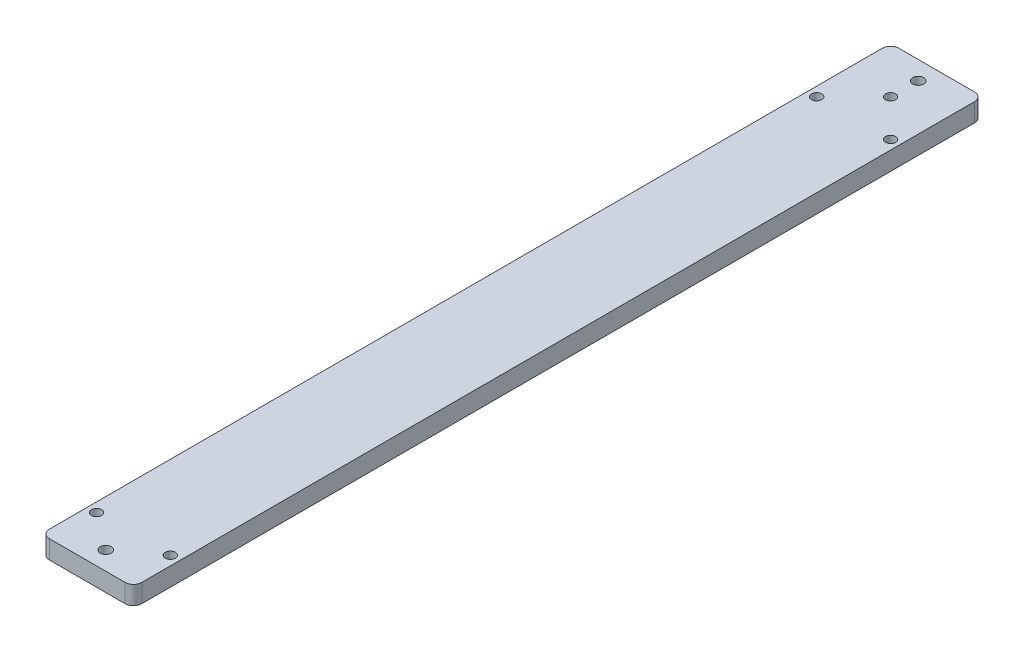
ISO-10303-21;
HEADER;
FILE_DESCRIPTION(('STEP AP214'),'2;1');
FILE_NAME('part.step','',(''),(''),'','','');
FILE_SCHEMA(('AUTOMOTIVE_DESIGN { 1 0 10303 214 1 1 1 1 }'));
ENDSEC;
DATA;
#1=APPLICATION_CONTEXT('core data for automotive mechanical design processes');
#2=APPLICATION_PROTOCOL_DEFINITION('international standard','automotive_design',2000,#1);
#3=PRODUCT_CONTEXT('',#1,'mechanical');
#4=PRODUCT('Part','Part','',(#3));
#5=PRODUCT_RELATED_PRODUCT_CATEGORY('part','',(#4));
#6=PRODUCT_DEFINITION_FORMATION('','',#4);
#7=PRODUCT_DEFINITION_CONTEXT('part definition',#1,'design');
#8=PRODUCT_DEFINITION('design','',#6,#7);
#9=PRODUCT_DEFINITION_SHAPE('','',#8);
#10=(LENGTH_UNIT() NAMED_UNIT(*) SI_UNIT(.MILLI.,.METRE.));
#11=(NAMED_UNIT(*) PLANE_ANGLE_UNIT() SI_UNIT($,.RADIAN.));
#12=(NAMED_UNIT(*) SI_UNIT($,.STERADIAN.) SOLID_ANGLE_UNIT());
#13=UNCERTAINTY_MEASURE_WITH_UNIT(LENGTH_MEASURE(1.E-05),#10,'distance_accuracy_value','');
#14=(GEOMETRIC_REPRESENTATION_CONTEXT(3) GLOBAL_UNCERTAINTY_ASSIGNED_CONTEXT((#13)) GLOBAL_UNIT_ASSIGNED_CONTEXT((#10,
#11,#12)) REPRESENTATION_CONTEXT('',''));
#15=CARTESIAN_POINT('',(0.,0.,0.));
#16=DIRECTION('',(0.,0.,1.));
#17=DIRECTION('',(1.,0.,0.));
#18=AXIS2_PLACEMENT_3D('',#15,#16,#17);
#19=CARTESIAN_POINT('',(32.3533259102885,0.000999999999999265,459.692172038795));
#20=DIRECTION('',(0.,-1.,0.));
#21=DIRECTION('',(0.,0.,-1.));
#22=AXIS2_PLACEMENT_3D('',#19,#20,#21);
#23=CYLINDRICAL_SURFACE('',#22,2.75);
#24=CARTESIAN_POINT('',(32.3533259102885,0.,459.692172038795));
#25=DIRECTION('',(0.,-1.,0.));
#26=DIRECTION('',(0.,0.,-1.));
#27=AXIS2_PLACEMENT_3D('',#24,#25,#26);
#28=CIRCLE('',#27,2.75);
#29=CARTESIAN_POINT('',(32.3533259102885,0.,456.942172038795));
#30=VERTEX_POINT('',#29);
#31=EDGE_CURVE('E163',#30,#30,#28,.F.);
#32=ORIENTED_EDGE('',*,*,#31,.T.);
#33=EDGE_LOOP('',(#32));
#34=FACE_BOUND('',#33,.T.);
#35=CARTESIAN_POINT('',(32.3533259102885,-4.5,459.692172038795));
#36=DIRECTION('',(0.,-1.,0.));
#37=DIRECTION('',(0.,0.,-1.));
#38=AXIS2_PLACEMENT_3D('',#35,#36,#37);
#39=CIRCLE('',#38,2.75);
#40=CARTESIAN_POINT('',(32.3533259102885,-4.5,456.942172038795));
#41=VERTEX_POINT('',#40);
#42=EDGE_CURVE('E165',#41,#41,#39,.F.);
#43=ORIENTED_EDGE('',*,*,#42,.F.);
#44=EDGE_LOOP('',(#43));
#45=FACE_BOUND('',#44,.T.);
#46=ADVANCED_FACE('F35',(#34,#45),#23,.F.);
#47=CARTESIAN_POINT('',(-7.64667408971147,0.000999999999999265,459.692172038795));
#48=DIRECTION('',(0.,-1.,0.));
#49=DIRECTION('',(0.,0.,-1.));
#50=AXIS2_PLACEMENT_3D('',#47,#48,#49);
#51=CYLINDRICAL_SURFACE('',#50,2.75);
#52=CARTESIAN_POINT('',(-7.64667408971147,0.,459.692172038795));
#53=DIRECTION('',(0.,-1.,0.));
#54=DIRECTION('',(0.,0.,-1.));
#55=AXIS2_PLACEMENT_3D('',#52,#53,#54);
#56=CIRCLE('',#55,2.75);
#57=CARTESIAN_POINT('',(-7.64667408971147,0.,456.942172038795));
#58=VERTEX_POINT('',#57);
#59=EDGE_CURVE('E226',#58,#58,#56,.F.);
#60=ORIENTED_EDGE('',*,*,#59,.T.);
#61=EDGE_LOOP('',(#60));
#62=FACE_BOUND('',#61,.T.);
#63=CARTESIAN_POINT('',(-7.64667408971147,-4.5,459.692172038795));
#64=DIRECTION('',(0.,-1.,0.));
#65=DIRECTION('',(0.,0.,-1.));
#66=AXIS2_PLACEMENT_3D('',#63,#64,#65);
#67=CIRCLE('',#66,2.75);
#68=CARTESIAN_POINT('',(-7.64667408971147,-4.5,456.942172038795));
#69=VERTEX_POINT('',#68);
#70=EDGE_CURVE('E160',#69,#69,#67,.F.);
#71=ORIENTED_EDGE('',*,*,#70,.F.);
#72=EDGE_LOOP('',(#71));
#73=FACE_BOUND('',#72,.T.);
#74=ADVANCED_FACE('F298',(#62,#73),#51,.F.);
#75=CARTESIAN_POINT('',(12.3533259102885,0.000999999999999265,49.6921720387952));
#76=DIRECTION('',(0.,-1.,0.));
#77=DIRECTION('',(0.,0.,-1.));
#78=AXIS2_PLACEMENT_3D('',#75,#76,#77);
#79=CYLINDRICAL_SURFACE('',#78,2.75);
#80=CARTESIAN_POINT('',(12.3533259102885,0.,49.6921720387952));
#81=DIRECTION('',(0.,-1.,0.));
#82=DIRECTION('',(0.,0.,-1.));
#83=AXIS2_PLACEMENT_3D('',#80,#81,#82);
#84=CIRCLE('',#83,2.75);
#85=CARTESIAN_POINT('',(12.3533259102885,0.,46.9421720387951));
#86=VERTEX_POINT('',#85);
#87=EDGE_CURVE('E148',#86,#86,#84,.F.);
#88=ORIENTED_EDGE('',*,*,#87,.T.);
#89=EDGE_LOOP('',(#88));
#90=FACE_BOUND('',#89,.T.);
#91=CARTESIAN_POINT('',(12.3533259102885,-4.5,49.6921720387952));
#92=DIRECTION('',(0.,-1.,0.));
#93=DIRECTION('',(0.,0.,-1.));
#94=AXIS2_PLACEMENT_3D('',#91,#92,#93);
#95=CIRCLE('',#94,2.75);
#96=CARTESIAN_POINT('',(12.3533259102885,-4.5,46.9421720387951));
#97=VERTEX_POINT('',#96);
#98=EDGE_CURVE('E155',#97,#97,#95,.F.);
#99=ORIENTED_EDGE('',*,*,#98,.F.);
#100=EDGE_LOOP('',(#99));
#101=FACE_BOUND('',#100,.T.);
#102=ADVANCED_FACE('F277',(#90,#101),#79,.F.);
#103=CARTESIAN_POINT('',(32.3533259102885,0.000999999999999265,69.6921720387952));
#104=DIRECTION('',(0.,-1.,0.));
#105=DIRECTION('',(0.,0.,-1.));
#106=AXIS2_PLACEMENT_3D('',#103,#104,#105);
#107=CYLINDRICAL_SURFACE('',#106,2.75);
#108=CARTESIAN_POINT('',(32.3533259102885,0.,69.6921720387952));
#109=DIRECTION('',(0.,-1.,0.));
#110=DIRECTION('',(0.,0.,-1.));
#111=AXIS2_PLACEMENT_3D('',#108,#109,#110);
#112=CIRCLE('',#111,2.75);
#113=CARTESIAN_POINT('',(32.3533259102885,0.,66.9421720387951));
#114=VERTEX_POINT('',#113);
#115=EDGE_CURVE('E130',#114,#114,#112,.F.);
#116=ORIENTED_EDGE('',*,*,#115,.T.);
#117=EDGE_LOOP('',(#116));
#118=FACE_BOUND('',#117,.T.);
#119=CARTESIAN_POINT('',(32.3533259102885,-4.5,69.6921720387952));
#120=DIRECTION('',(0.,-1.,0.));
#121=DIRECTION('',(0.,0.,-1.));
#122=AXIS2_PLACEMENT_3D('',#119,#120,#121);
#123=CIRCLE('',#122,2.75);
#124=CARTESIAN_POINT('',(32.3533259102885,-4.5,66.9421720387951));
#125=VERTEX_POINT('',#124);
#126=EDGE_CURVE('E150',#125,#125,#123,.F.);
#127=ORIENTED_EDGE('',*,*,#126,.F.);
#128=EDGE_LOOP('',(#127));
#129=FACE_BOUND('',#128,.T.);
#130=ADVANCED_FACE('F273',(#118,#129),#107,.F.);
#131=CARTESIAN_POINT('',(-7.64667408971147,0.000999999999999265,69.6921720387952));
#132=DIRECTION('',(0.,-1.,0.));
#133=DIRECTION('',(0.,0.,-1.));
#134=AXIS2_PLACEMENT_3D('',#131,#132,#133);
#135=CYLINDRICAL_SURFACE('',#134,2.75);
#136=CARTESIAN_POINT('',(-7.64667408971147,0.,69.6921720387952));
#137=DIRECTION('',(0.,-1.,0.));
#138=DIRECTION('',(0.,0.,-1.));
#139=AXIS2_PLACEMENT_3D('',#136,#137,#138);
#140=CIRCLE('',#139,2.75);
#141=CARTESIAN_POINT('',(-7.64667408971147,0.,66.9421720387951));
#142=VERTEX_POINT('',#141);
#143=EDGE_CURVE('E136',#142,#142,#140,.F.);
#144=ORIENTED_EDGE('',*,*,#143,.T.);
#145=EDGE_LOOP('',(#144));
#146=FACE_BOUND('',#145,.T.);
#147=CARTESIAN_POINT('',(-7.64667408971147,-4.5,69.6921720387952));
#148=DIRECTION('',(0.,-1.,0.));
#149=DIRECTION('',(0.,0.,-1.));
#150=AXIS2_PLACEMENT_3D('',#147,#148,#149);
#151=CIRCLE('',#150,2.75);
#152=CARTESIAN_POINT('',(-7.64667408971147,-4.5,66.9421720387951));
#153=VERTEX_POINT('',#152);
#154=EDGE_CURVE('E145',#153,#153,#151,.F.);
#155=ORIENTED_EDGE('',*,*,#154,.F.);
#156=EDGE_LOOP('',(#155));
#157=FACE_BOUND('',#156,.T.);
#158=ADVANCED_FACE('F276',(#146,#157),#135,.F.);
#159=CARTESIAN_POINT('',(37.3533259102885,-10.,24.6921720387952));
#160=DIRECTION('',(-1.,0.,0.));
#161=DIRECTION('',(0.,0.,1.));
#162=AXIS2_PLACEMENT_3D('',#159,#160,#161);
#163=PLANE('',#162);
#164=DIRECTION('',(0.,0.,1.));
#165=VECTOR('',#164,1.);
#166=CARTESIAN_POINT('',(37.3533259102885,-10.,24.6921720387952));
#167=LINE('',#166,#165);
#168=CARTESIAN_POINT('',(37.3533259102885,-10.,29.1921720387952));
#169=VERTEX_POINT('',#168);
#170=CARTESIAN_POINT('',(37.3533259102885,-10.,480.192172038795));
#171=VERTEX_POINT('',#170);
#172=EDGE_CURVE('E122',#169,#171,#167,.T.);
#173=ORIENTED_EDGE('',*,*,#172,.F.);
#174=DIRECTION('',(0.,1.,0.));
#175=VECTOR('',#174,1.);
#176=CARTESIAN_POINT('',(37.3533259102885,-10.,29.1921720387952));
#177=LINE('',#176,#175);
#178=CARTESIAN_POINT('',(37.3533259102885,0.,29.1921720387952));
#179=VERTEX_POINT('',#178);
#180=EDGE_CURVE('E106',#169,#179,#177,.T.);
#181=ORIENTED_EDGE('',*,*,#180,.T.);
#182=DIRECTION('',(0.,0.,1.));
#183=VECTOR('',#182,1.);
#184=CARTESIAN_POINT('',(37.3533259102885,0.,24.6921720387952));
#185=LINE('',#184,#183);
#186=CARTESIAN_POINT('',(37.3533259102885,0.,480.192172038795));
#187=VERTEX_POINT('',#186);
#188=EDGE_CURVE('E119',#179,#187,#185,.T.);
#189=ORIENTED_EDGE('',*,*,#188,.T.);
#190=DIRECTION('',(0.,1.,0.));
#191=VECTOR('',#190,1.);
#192=CARTESIAN_POINT('',(37.3533259102885,-10.,480.192172038795));
#193=LINE('',#192,#191);
#194=EDGE_CURVE('E124',#187,#171,#193,.F.);
#195=ORIENTED_EDGE('',*,*,#194,.T.);
#196=EDGE_LOOP('',(#173,#181,#189,#195));
#197=FACE_BOUND('',#196,.T.);
#198=ADVANCED_FACE('F118',(#197),#163,.F.);
#199=CARTESIAN_POINT('',(37.3533259102885,-10.,484.692172038795));
#200=DIRECTION('',(0.,0.,-1.));
#201=DIRECTION('',(-1.,0.,0.));
#202=AXIS2_PLACEMENT_3D('',#199,#200,#201);
#203=PLANE('',#202);
#204=DIRECTION('',(-1.,0.,0.));
#205=VECTOR('',#204,1.);
#206=CARTESIAN_POINT('',(37.3533259102885,-10.,484.692172038795));
#207=LINE('',#206,#205);
#208=CARTESIAN_POINT('',(32.8533259102885,-10.,484.692172038795));
#209=VERTEX_POINT('',#208);
#210=CARTESIAN_POINT('',(-8.14667408971147,-10.,484.692172038795));
#211=VERTEX_POINT('',#210);
#212=EDGE_CURVE('E191',#209,#211,#207,.T.);
#213=ORIENTED_EDGE('',*,*,#212,.F.);
#214=DIRECTION('',(0.,1.,0.));
#215=VECTOR('',#214,1.);
#216=CARTESIAN_POINT('',(32.8533259102885,-10.,484.692172038795));
#217=LINE('',#216,#215);
#218=CARTESIAN_POINT('',(32.8533259102885,0.,484.692172038795));
#219=VERTEX_POINT('',#218);
#220=EDGE_CURVE('E12',#209,#219,#217,.T.);
#221=ORIENTED_EDGE('',*,*,#220,.T.);
#222=DIRECTION('',(-1.,0.,0.));
#223=VECTOR('',#222,1.);
#224=CARTESIAN_POINT('',(37.3533259102885,0.,484.692172038795));
#225=LINE('',#224,#223);
#226=CARTESIAN_POINT('',(-8.14667408971147,0.,484.692172038795));
#227=VERTEX_POINT('',#226);
#228=EDGE_CURVE('E129',#219,#227,#225,.T.);
#229=ORIENTED_EDGE('',*,*,#228,.T.);
#230=DIRECTION('',(0.,1.,0.));
#231=VECTOR('',#230,1.);
#232=CARTESIAN_POINT('',(-8.14667408971147,-10.,484.692172038795));
#233=LINE('',#232,#231);
#234=EDGE_CURVE('E43',#227,#211,#233,.F.);
#235=ORIENTED_EDGE('',*,*,#234,.T.);
#236=EDGE_LOOP('',(#213,#221,#229,#235));
#237=FACE_BOUND('',#236,.T.);
#238=ADVANCED_FACE('F190',(#237),#203,.F.);
#239=CARTESIAN_POINT('',(-12.6466740897115,-10.,24.6921720387951));
#240=DIRECTION('',(1.,0.,0.));
#241=DIRECTION('',(0.,0.,-1.));
#242=AXIS2_PLACEMENT_3D('',#239,#240,#241);
#243=PLANE('',#242);
#244=DIRECTION('',(0.,0.,-1.));
#245=VECTOR('',#244,1.);
#246=CARTESIAN_POINT('',(-12.6466740897115,0.,24.6921720387951));
#247=LINE('',#246,#245);
#248=CARTESIAN_POINT('',(-12.6466740897115,0.,480.192172038795));
#249=VERTEX_POINT('',#248);
#250=CARTESIAN_POINT('',(-12.6466740897115,0.,29.1921720387951));
#251=VERTEX_POINT('',#250);
#252=EDGE_CURVE('E133',#249,#251,#247,.T.);
#253=ORIENTED_EDGE('',*,*,#252,.T.);
#254=DIRECTION('',(0.,1.,0.));
#255=VECTOR('',#254,1.);
#256=CARTESIAN_POINT('',(-12.6466740897115,-10.,29.1921720387951));
#257=LINE('',#256,#255);
#258=CARTESIAN_POINT('',(-12.6466740897115,-10.,29.1921720387951));
#259=VERTEX_POINT('',#258);
#260=EDGE_CURVE('E50',#251,#259,#257,.F.);
#261=ORIENTED_EDGE('',*,*,#260,.T.);
#262=DIRECTION('',(0.,0.,-1.));
#263=VECTOR('',#262,1.);
#264=CARTESIAN_POINT('',(-12.6466740897115,-10.,24.6921720387951));
#265=LINE('',#264,#263);
#266=CARTESIAN_POINT('',(-12.6466740897115,-10.,480.192172038795));
#267=VERTEX_POINT('',#266);
#268=EDGE_CURVE('E197',#267,#259,#265,.T.);
#269=ORIENTED_EDGE('',*,*,#268,.F.);
#270=DIRECTION('',(0.,1.,0.));
#271=VECTOR('',#270,1.);
#272=CARTESIAN_POINT('',(-12.6466740897115,-10.,480.192172038795));
#273=LINE('',#272,#271);
#274=EDGE_CURVE('E184',#267,#249,#273,.T.);
#275=ORIENTED_EDGE('',*,*,#274,.T.);
#276=EDGE_LOOP('',(#253,#261,#269,#275));
#277=FACE_BOUND('',#276,.T.);
#278=ADVANCED_FACE('F201',(#277),#243,.F.);
#279=CARTESIAN_POINT('',(37.3533259102885,-10.,24.6921720387952));
#280=DIRECTION('',(0.,0.,1.));
#281=DIRECTION('',(1.,0.,0.));
#282=AXIS2_PLACEMENT_3D('',#279,#280,#281);
#283=PLANE('',#282);
#284=DIRECTION('',(1.,0.,0.));
#285=VECTOR('',#284,1.);
#286=CARTESIAN_POINT('',(37.3533259102885,0.,24.6921720387952));
#287=LINE('',#286,#285);
#288=CARTESIAN_POINT('',(-8.14667408971147,0.,24.6921720387951));
#289=VERTEX_POINT('',#288);
#290=CARTESIAN_POINT('',(32.8533259102885,0.,24.6921720387952));
#291=VERTEX_POINT('',#290);
#292=EDGE_CURVE('E143',#289,#291,#287,.T.);
#293=ORIENTED_EDGE('',*,*,#292,.T.);
#294=DIRECTION('',(0.,1.,0.));
#295=VECTOR('',#294,1.);
#296=CARTESIAN_POINT('',(32.8533259102885,-10.,24.6921720387952));
#297=LINE('',#296,#295);
#298=CARTESIAN_POINT('',(32.8533259102885,-10.,24.6921720387952));
#299=VERTEX_POINT('',#298);
#300=EDGE_CURVE('E107',#291,#299,#297,.F.);
#301=ORIENTED_EDGE('',*,*,#300,.T.);
#302=DIRECTION('',(1.,0.,0.));
#303=VECTOR('',#302,1.);
#304=CARTESIAN_POINT('',(37.3533259102885,-10.,24.6921720387952));
#305=LINE('',#304,#303);
#306=CARTESIAN_POINT('',(-8.14667408971147,-10.,24.6921720387951));
#307=VERTEX_POINT('',#306);
#308=EDGE_CURVE('E139',#307,#299,#305,.T.);
#309=ORIENTED_EDGE('',*,*,#308,.F.);
#310=DIRECTION('',(0.,1.,0.));
#311=VECTOR('',#310,1.);
#312=CARTESIAN_POINT('',(-8.14667408971147,-10.,24.6921720387951));
#313=LINE('',#312,#311);
#314=EDGE_CURVE('E112',#307,#289,#313,.T.);
#315=ORIENTED_EDGE('',*,*,#314,.T.);
#316=EDGE_LOOP('',(#293,#301,#309,#315));
#317=FACE_BOUND('',#316,.T.);
#318=ADVANCED_FACE('F208',(#317),#283,.F.);
#319=CARTESIAN_POINT('',(37.3533259102885,-10.,484.692172038795));
#320=DIRECTION('',(0.,-1.,0.));
#321=DIRECTION('',(0.,0.,-1.));
#322=AXIS2_PLACEMENT_3D('',#319,#320,#321);
#323=PLANE('',#322);
#324=CARTESIAN_POINT('',(12.3533259102885,-10.,34.6921720387951));
#325=DIRECTION('',(0.,-1.,0.));
#326=DIRECTION('',(0.,0.,-1.));
#327=AXIS2_PLACEMENT_3D('',#324,#325,#326);
#328=CIRCLE('',#327,3.);
#329=CARTESIAN_POINT('',(12.3533259102885,-10.,31.6921720387951));
#330=VERTEX_POINT('',#329);
#331=EDGE_CURVE('E249',#330,#330,#328,.F.);
#332=ORIENTED_EDGE('',*,*,#331,.T.);
#333=EDGE_LOOP('',(#332));
#334=FACE_BOUND('',#333,.T.);
#335=CARTESIAN_POINT('',(12.3533259102885,-10.,474.692172038795));
#336=DIRECTION('',(0.,-1.,0.));
#337=DIRECTION('',(0.,0.,-1.));
#338=AXIS2_PLACEMENT_3D('',#335,#336,#337);
#339=CIRCLE('',#338,3.);
#340=CARTESIAN_POINT('',(12.3533259102885,-10.,471.692172038795));
#341=VERTEX_POINT('',#340);
#342=EDGE_CURVE('E243',#341,#341,#339,.F.);
#343=ORIENTED_EDGE('',*,*,#342,.T.);
#344=EDGE_LOOP('',(#343));
#345=FACE_BOUND('',#344,.T.);
#346=CARTESIAN_POINT('',(32.3533259102885,-10.,459.692172038795));
#347=DIRECTION('',(0.,-1.,0.));
#348=DIRECTION('',(0.,0.,-1.));
#349=AXIS2_PLACEMENT_3D('',#346,#347,#348);
#350=CIRCLE('',#349,4.49999999999999);
#351=CARTESIAN_POINT('',(32.3533259102885,-10.,455.192172038795));
#352=VERTEX_POINT('',#351);
#353=EDGE_CURVE('E237',#352,#352,#350,.T.);
#354=ORIENTED_EDGE('',*,*,#353,.F.);
#355=EDGE_LOOP('',(#354));
#356=FACE_BOUND('',#355,.T.);
#357=CARTESIAN_POINT('',(-7.64667408971147,-10.,459.692172038795));
#358=DIRECTION('',(0.,-1.,0.));
#359=DIRECTION('',(0.,0.,-1.));
#360=AXIS2_PLACEMENT_3D('',#357,#358,#359);
#361=CIRCLE('',#360,4.49999999999999);
#362=CARTESIAN_POINT('',(-7.64667408971147,-10.,455.192172038795));
#363=VERTEX_POINT('',#362);
#364=EDGE_CURVE('E168',#363,#363,#361,.T.);
#365=ORIENTED_EDGE('',*,*,#364,.F.);
#366=EDGE_LOOP('',(#365));
#367=FACE_BOUND('',#366,.T.);
#368=CARTESIAN_POINT('',(12.3533259102885,-10.,49.6921720387952));
#369=DIRECTION('',(0.,-1.,0.));
#370=DIRECTION('',(0.,0.,-1.));
#371=AXIS2_PLACEMENT_3D('',#368,#369,#370);
#372=CIRCLE('',#371,4.50000000000001);
#373=CARTESIAN_POINT('',(12.3533259102885,-10.,45.1921720387951));
#374=VERTEX_POINT('',#373);
#375=EDGE_CURVE('E223',#374,#374,#372,.T.);
#376=ORIENTED_EDGE('',*,*,#375,.F.);
#377=EDGE_LOOP('',(#376));
#378=FACE_BOUND('',#377,.T.);
#379=CARTESIAN_POINT('',(32.3533259102885,-10.,69.6921720387952));
#380=DIRECTION('',(0.,-1.,0.));
#381=DIRECTION('',(0.,0.,-1.));
#382=AXIS2_PLACEMENT_3D('',#379,#380,#381);
#383=CIRCLE('',#382,4.5);
#384=CARTESIAN_POINT('',(32.3533259102885,-10.,65.1921720387951));
#385=VERTEX_POINT('',#384);
#386=EDGE_CURVE('E158',#385,#385,#383,.T.);
#387=ORIENTED_EDGE('',*,*,#386,.F.);
#388=EDGE_LOOP('',(#387));
#389=FACE_BOUND('',#388,.T.);
#390=CARTESIAN_POINT('',(-7.64667408971147,-10.,69.6921720387952));
#391=DIRECTION('',(0.,-1.,0.));
#392=DIRECTION('',(0.,0.,-1.));
#393=AXIS2_PLACEMENT_3D('',#390,#391,#392);
#394=CIRCLE('',#393,4.5);
#395=CARTESIAN_POINT('',(-7.64667408971147,-10.,65.1921720387951));
#396=VERTEX_POINT('',#395);
#397=EDGE_CURVE('E153',#396,#396,#394,.T.);
#398=ORIENTED_EDGE('',*,*,#397,.F.);
#399=EDGE_LOOP('',(#398));
#400=FACE_BOUND('',#399,.T.);
#401=ORIENTED_EDGE('',*,*,#308,.T.);
#402=CARTESIAN_POINT('',(32.8533259102885,-10.,29.1921720387952));
#403=DIRECTION('',(0.,-1.,0.));
#404=DIRECTION('',(0.,0.,-1.));
#405=AXIS2_PLACEMENT_3D('',#402,#403,#404);
#406=CIRCLE('',#405,4.5);
#407=EDGE_CURVE('E182',#299,#169,#406,.T.);
#408=ORIENTED_EDGE('',*,*,#407,.T.);
#409=ORIENTED_EDGE('',*,*,#172,.T.);
#410=CARTESIAN_POINT('',(32.8533259102885,-10.,480.192172038795));
#411=DIRECTION('',(0.,-1.,0.));
#412=DIRECTION('',(0.,0.,-1.));
#413=AXIS2_PLACEMENT_3D('',#410,#411,#412);
#414=CIRCLE('',#413,4.5);
#415=EDGE_CURVE('E178',#171,#209,#414,.T.);
#416=ORIENTED_EDGE('',*,*,#415,.T.);
#417=ORIENTED_EDGE('',*,*,#212,.T.);
#418=CARTESIAN_POINT('',(-8.14667408971147,-10.,480.192172038795));
#419=DIRECTION('',(0.,-1.,0.));
#420=DIRECTION('',(0.,0.,-1.));
#421=AXIS2_PLACEMENT_3D('',#418,#419,#420);
#422=CIRCLE('',#421,4.5);
#423=EDGE_CURVE('E57',#211,#267,#422,.T.);
#424=ORIENTED_EDGE('',*,*,#423,.T.);
#425=ORIENTED_EDGE('',*,*,#268,.T.);
#426=CARTESIAN_POINT('',(-8.14667408971147,-10.,29.1921720387951));
#427=DIRECTION('',(0.,-1.,0.));
#428=DIRECTION('',(0.,0.,-1.));
#429=AXIS2_PLACEMENT_3D('',#426,#427,#428);
#430=CIRCLE('',#429,4.5);
#431=EDGE_CURVE('E180',#259,#307,#430,.T.);
#432=ORIENTED_EDGE('',*,*,#431,.T.);
#433=EDGE_LOOP('',(#401,#408,#409,#416,#417,#424,#425,#432));
#434=FACE_BOUND('',#433,.T.);
#435=ADVANCED_FACE('F195',(#334,#345,#356,#367,#378,#389,#400,#434),#323,.T.);
#436=CARTESIAN_POINT('',(37.3533259102885,0.,484.692172038795));
#437=DIRECTION('',(0.,-1.,0.));
#438=DIRECTION('',(0.,0.,-1.));
#439=AXIS2_PLACEMENT_3D('',#436,#437,#438);
#440=PLANE('',#439);
#441=CARTESIAN_POINT('',(12.3533259102885,0.,34.6921720387951));
#442=DIRECTION('',(0.,1.,0.));
#443=DIRECTION('',(0.,0.,1.));
#444=AXIS2_PLACEMENT_3D('',#441,#442,#443);
#445=CIRCLE('',#444,3.);
#446=CARTESIAN_POINT('',(12.3533259102885,0.,37.6921720387951));
#447=VERTEX_POINT('',#446);
#448=EDGE_CURVE('E246',#447,#447,#445,.T.);
#449=ORIENTED_EDGE('',*,*,#448,.F.);
#450=EDGE_LOOP('',(#449));
#451=FACE_BOUND('',#450,.T.);
#452=CARTESIAN_POINT('',(12.3533259102885,0.,474.692172038795));
#453=DIRECTION('',(0.,1.,0.));
#454=DIRECTION('',(0.,0.,1.));
#455=AXIS2_PLACEMENT_3D('',#452,#453,#454);
#456=CIRCLE('',#455,3.);
#457=CARTESIAN_POINT('',(12.3533259102885,0.,477.692172038795));
#458=VERTEX_POINT('',#457);
#459=EDGE_CURVE('E240',#458,#458,#456,.T.);
#460=ORIENTED_EDGE('',*,*,#459,.F.);
#461=EDGE_LOOP('',(#460));
#462=FACE_BOUND('',#461,.T.);
#463=ORIENTED_EDGE('',*,*,#31,.F.);
#464=EDGE_LOOP('',(#463));
#465=FACE_BOUND('',#464,.T.);
#466=ORIENTED_EDGE('',*,*,#59,.F.);
#467=EDGE_LOOP('',(#466));
#468=FACE_BOUND('',#467,.T.);
#469=ORIENTED_EDGE('',*,*,#87,.F.);
#470=EDGE_LOOP('',(#469));
#471=FACE_BOUND('',#470,.T.);
#472=ORIENTED_EDGE('',*,*,#143,.F.);
#473=EDGE_LOOP('',(#472));
#474=FACE_BOUND('',#473,.T.);
#475=ORIENTED_EDGE('',*,*,#115,.F.);
#476=EDGE_LOOP('',(#475));
#477=FACE_BOUND('',#476,.T.);
#478=ORIENTED_EDGE('',*,*,#188,.F.);
#479=CARTESIAN_POINT('',(32.8533259102885,0.,29.1921720387952));
#480=DIRECTION('',(0.,-1.,0.));
#481=DIRECTION('',(0.,0.,-1.));
#482=AXIS2_PLACEMENT_3D('',#479,#480,#481);
#483=CIRCLE('',#482,4.5);
#484=EDGE_CURVE('E102',#179,#291,#483,.F.);
#485=ORIENTED_EDGE('',*,*,#484,.T.);
#486=ORIENTED_EDGE('',*,*,#292,.F.);
#487=CARTESIAN_POINT('',(-8.14667408971147,0.,29.1921720387951));
#488=DIRECTION('',(0.,-1.,0.));
#489=DIRECTION('',(0.,0.,-1.));
#490=AXIS2_PLACEMENT_3D('',#487,#488,#489);
#491=CIRCLE('',#490,4.5);
#492=EDGE_CURVE('E113',#289,#251,#491,.F.);
#493=ORIENTED_EDGE('',*,*,#492,.T.);
#494=ORIENTED_EDGE('',*,*,#252,.F.);
#495=CARTESIAN_POINT('',(-8.14667408971147,0.,480.192172038795));
#496=DIRECTION('',(0.,-1.,0.));
#497=DIRECTION('',(0.,0.,-1.));
#498=AXIS2_PLACEMENT_3D('',#495,#496,#497);
#499=CIRCLE('',#498,4.5);
#500=EDGE_CURVE('E123',#249,#227,#499,.F.);
#501=ORIENTED_EDGE('',*,*,#500,.T.);
#502=ORIENTED_EDGE('',*,*,#228,.F.);
#503=CARTESIAN_POINT('',(32.8533259102885,0.,480.192172038795));
#504=DIRECTION('',(0.,-1.,0.));
#505=DIRECTION('',(0.,0.,-1.));
#506=AXIS2_PLACEMENT_3D('',#503,#504,#505);
#507=CIRCLE('',#506,4.5);
#508=EDGE_CURVE('E128',#219,#187,#507,.F.);
#509=ORIENTED_EDGE('',*,*,#508,.T.);
#510=EDGE_LOOP('',(#478,#485,#486,#493,#494,#501,#502,#509));
#511=FACE_BOUND('',#510,.T.);
#512=ADVANCED_FACE('F126',(#451,#462,#465,#468,#471,#474,#477,#511),#440,.F.);
#513=CARTESIAN_POINT('',(-7.64667408971147,-4.5,69.6921720387952));
#514=DIRECTION('',(0.,-1.,0.));
#515=DIRECTION('',(0.,0.,-1.));
#516=AXIS2_PLACEMENT_3D('',#513,#514,#515);
#517=PLANE('',#516);
#518=CARTESIAN_POINT('',(-7.64667408971147,-4.5,69.6921720387952));
#519=DIRECTION('',(0.,-1.,0.));
#520=DIRECTION('',(0.,0.,-1.));
#521=AXIS2_PLACEMENT_3D('',#518,#519,#520);
#522=CIRCLE('',#521,4.5);
#523=CARTESIAN_POINT('',(-7.64667408971147,-4.5,65.1921720387951));
#524=VERTEX_POINT('',#523);
#525=EDGE_CURVE('E149',#524,#524,#522,.T.);
#526=ORIENTED_EDGE('',*,*,#525,.T.);
#527=EDGE_LOOP('',(#526));
#528=FACE_BOUND('',#527,.T.);
#529=ORIENTED_EDGE('',*,*,#154,.T.);
#530=EDGE_LOOP('',(#529));
#531=FACE_BOUND('',#530,.T.);
#532=ADVANCED_FACE('F259',(#528,#531),#517,.T.);
#533=CARTESIAN_POINT('',(-7.64667408971147,-4.5,69.6921720387952));
#534=DIRECTION('',(0.,-1.,0.));
#535=DIRECTION('',(0.,0.,-1.));
#536=AXIS2_PLACEMENT_3D('',#533,#534,#535);
#537=CYLINDRICAL_SURFACE('',#536,4.5);
#538=ORIENTED_EDGE('',*,*,#525,.F.);
#539=EDGE_LOOP('',(#538));
#540=FACE_BOUND('',#539,.T.);
#541=ORIENTED_EDGE('',*,*,#397,.T.);
#542=EDGE_LOOP('',(#541));
#543=FACE_BOUND('',#542,.T.);
#544=ADVANCED_FACE('F284',(#540,#543),#537,.F.);
#545=CARTESIAN_POINT('',(32.3533259102885,-4.5,69.6921720387952));
#546=DIRECTION('',(0.,-1.,0.));
#547=DIRECTION('',(0.,0.,-1.));
#548=AXIS2_PLACEMENT_3D('',#545,#546,#547);
#549=PLANE('',#548);
#550=CARTESIAN_POINT('',(32.3533259102885,-4.5,69.6921720387952));
#551=DIRECTION('',(0.,-1.,0.));
#552=DIRECTION('',(0.,0.,-1.));
#553=AXIS2_PLACEMENT_3D('',#550,#551,#552);
#554=CIRCLE('',#553,4.5);
#555=CARTESIAN_POINT('',(32.3533259102885,-4.5,65.1921720387951));
#556=VERTEX_POINT('',#555);
#557=EDGE_CURVE('E154',#556,#556,#554,.T.);
#558=ORIENTED_EDGE('',*,*,#557,.T.);
#559=EDGE_LOOP('',(#558));
#560=FACE_BOUND('',#559,.T.);
#561=ORIENTED_EDGE('',*,*,#126,.T.);
#562=EDGE_LOOP('',(#561));
#563=FACE_BOUND('',#562,.T.);
#564=ADVANCED_FACE('F281',(#560,#563),#549,.T.);
#565=CARTESIAN_POINT('',(32.3533259102885,-4.5,69.6921720387952));
#566=DIRECTION('',(0.,-1.,0.));
#567=DIRECTION('',(0.,0.,-1.));
#568=AXIS2_PLACEMENT_3D('',#565,#566,#567);
#569=CYLINDRICAL_SURFACE('',#568,4.5);
#570=ORIENTED_EDGE('',*,*,#557,.F.);
#571=EDGE_LOOP('',(#570));
#572=FACE_BOUND('',#571,.T.);
#573=ORIENTED_EDGE('',*,*,#386,.T.);
#574=EDGE_LOOP('',(#573));
#575=FACE_BOUND('',#574,.T.);
#576=ADVANCED_FACE('F283',(#572,#575),#569,.F.);
#577=CARTESIAN_POINT('',(12.3533259102885,-4.5,49.6921720387952));
#578=DIRECTION('',(0.,-1.,0.));
#579=DIRECTION('',(0.,0.,-1.));
#580=AXIS2_PLACEMENT_3D('',#577,#578,#579);
#581=PLANE('',#580);
#582=CARTESIAN_POINT('',(12.3533259102885,-4.5,49.6921720387952));
#583=DIRECTION('',(0.,-1.,0.));
#584=DIRECTION('',(0.,0.,-1.));
#585=AXIS2_PLACEMENT_3D('',#582,#583,#584);
#586=CIRCLE('',#585,4.50000000000001);
#587=CARTESIAN_POINT('',(12.3533259102885,-4.5,45.1921720387951));
#588=VERTEX_POINT('',#587);
#589=EDGE_CURVE('E159',#588,#588,#586,.T.);
#590=ORIENTED_EDGE('',*,*,#589,.T.);
#591=EDGE_LOOP('',(#590));
#592=FACE_BOUND('',#591,.T.);
#593=ORIENTED_EDGE('',*,*,#98,.T.);
#594=EDGE_LOOP('',(#593));
#595=FACE_BOUND('',#594,.T.);
#596=ADVANCED_FACE('F291',(#592,#595),#581,.T.);
#597=CARTESIAN_POINT('',(12.3533259102885,-4.5,49.6921720387952));
#598=DIRECTION('',(0.,-1.,0.));
#599=DIRECTION('',(0.,0.,-1.));
#600=AXIS2_PLACEMENT_3D('',#597,#598,#599);
#601=CYLINDRICAL_SURFACE('',#600,4.50000000000001);
#602=ORIENTED_EDGE('',*,*,#589,.F.);
#603=EDGE_LOOP('',(#602));
#604=FACE_BOUND('',#603,.T.);
#605=ORIENTED_EDGE('',*,*,#375,.T.);
#606=EDGE_LOOP('',(#605));
#607=FACE_BOUND('',#606,.T.);
#608=ADVANCED_FACE('F312',(#604,#607),#601,.F.);
#609=CARTESIAN_POINT('',(-7.64667408971147,-4.5,459.692172038795));
#610=DIRECTION('',(0.,-1.,0.));
#611=DIRECTION('',(0.,0.,-1.));
#612=AXIS2_PLACEMENT_3D('',#609,#610,#611);
#613=PLANE('',#612);
#614=CARTESIAN_POINT('',(-7.64667408971147,-4.5,459.692172038795));
#615=DIRECTION('',(0.,-1.,0.));
#616=DIRECTION('',(0.,0.,-1.));
#617=AXIS2_PLACEMENT_3D('',#614,#615,#616);
#618=CIRCLE('',#617,4.49999999999999);
#619=CARTESIAN_POINT('',(-7.64667408971147,-4.5,455.192172038795));
#620=VERTEX_POINT('',#619);
#621=EDGE_CURVE('E164',#620,#620,#618,.T.);
#622=ORIENTED_EDGE('',*,*,#621,.T.);
#623=EDGE_LOOP('',(#622));
#624=FACE_BOUND('',#623,.T.);
#625=ORIENTED_EDGE('',*,*,#70,.T.);
#626=EDGE_LOOP('',(#625));
#627=FACE_BOUND('',#626,.T.);
#628=ADVANCED_FACE('F315',(#624,#627),#613,.T.);
#629=CARTESIAN_POINT('',(-7.64667408971147,-4.5,459.692172038795));
#630=DIRECTION('',(0.,-1.,0.));
#631=DIRECTION('',(0.,0.,-1.));
#632=AXIS2_PLACEMENT_3D('',#629,#630,#631);
#633=CYLINDRICAL_SURFACE('',#632,4.49999999999999);
#634=ORIENTED_EDGE('',*,*,#621,.F.);
#635=EDGE_LOOP('',(#634));
#636=FACE_BOUND('',#635,.T.);
#637=ORIENTED_EDGE('',*,*,#364,.T.);
#638=EDGE_LOOP('',(#637));
#639=FACE_BOUND('',#638,.T.);
#640=ADVANCED_FACE('F308',(#636,#639),#633,.F.);
#641=CARTESIAN_POINT('',(32.3533259102885,-4.5,459.692172038795));
#642=DIRECTION('',(0.,-1.,0.));
#643=DIRECTION('',(0.,0.,-1.));
#644=AXIS2_PLACEMENT_3D('',#641,#642,#643);
#645=PLANE('',#644);
#646=CARTESIAN_POINT('',(32.3533259102885,-4.5,459.692172038795));
#647=DIRECTION('',(0.,-1.,0.));
#648=DIRECTION('',(0.,0.,-1.));
#649=AXIS2_PLACEMENT_3D('',#646,#647,#648);
#650=CIRCLE('',#649,4.49999999999999);
#651=CARTESIAN_POINT('',(32.3533259102885,-4.5,455.192172038795));
#652=VERTEX_POINT('',#651);
#653=EDGE_CURVE('E169',#652,#652,#650,.T.);
#654=ORIENTED_EDGE('',*,*,#653,.T.);
#655=EDGE_LOOP('',(#654));
#656=FACE_BOUND('',#655,.T.);
#657=ORIENTED_EDGE('',*,*,#42,.T.);
#658=EDGE_LOOP('',(#657));
#659=FACE_BOUND('',#658,.T.);
#660=ADVANCED_FACE('F371',(#656,#659),#645,.T.);
#661=CARTESIAN_POINT('',(32.3533259102885,-4.5,459.692172038795));
#662=DIRECTION('',(0.,-1.,0.));
#663=DIRECTION('',(0.,0.,-1.));
#664=AXIS2_PLACEMENT_3D('',#661,#662,#663);
#665=CYLINDRICAL_SURFACE('',#664,4.49999999999999);
#666=ORIENTED_EDGE('',*,*,#653,.F.);
#667=EDGE_LOOP('',(#666));
#668=FACE_BOUND('',#667,.T.);
#669=ORIENTED_EDGE('',*,*,#353,.T.);
#670=EDGE_LOOP('',(#669));
#671=FACE_BOUND('',#670,.T.);
#672=ADVANCED_FACE('F349',(#668,#671),#665,.F.);
#673=CARTESIAN_POINT('',(32.8533259102885,-10.,29.1921720387952));
#674=DIRECTION('',(0.,1.,0.));
#675=DIRECTION('',(0.,0.,1.));
#676=AXIS2_PLACEMENT_3D('',#673,#674,#675);
#677=CYLINDRICAL_SURFACE('',#676,4.5);
#678=ORIENTED_EDGE('',*,*,#407,.F.);
#679=ORIENTED_EDGE('',*,*,#300,.F.);
#680=ORIENTED_EDGE('',*,*,#484,.F.);
#681=ORIENTED_EDGE('',*,*,#180,.F.);
#682=EDGE_LOOP('',(#678,#679,#680,#681));
#683=FACE_BOUND('',#682,.T.);
#684=ADVANCED_FACE('F105',(#683),#677,.T.);
#685=CARTESIAN_POINT('',(-8.14667408971147,-10.,29.1921720387951));
#686=DIRECTION('',(0.,1.,0.));
#687=DIRECTION('',(0.,0.,1.));
#688=AXIS2_PLACEMENT_3D('',#685,#686,#687);
#689=CYLINDRICAL_SURFACE('',#688,4.5);
#690=ORIENTED_EDGE('',*,*,#431,.F.);
#691=ORIENTED_EDGE('',*,*,#260,.F.);
#692=ORIENTED_EDGE('',*,*,#492,.F.);
#693=ORIENTED_EDGE('',*,*,#314,.F.);
#694=EDGE_LOOP('',(#690,#691,#692,#693));
#695=FACE_BOUND('',#694,.T.);
#696=ADVANCED_FACE('F205',(#695),#689,.T.);
#697=CARTESIAN_POINT('',(32.8533259102885,-10.,480.192172038795));
#698=DIRECTION('',(0.,1.,0.));
#699=DIRECTION('',(0.,0.,1.));
#700=AXIS2_PLACEMENT_3D('',#697,#698,#699);
#701=CYLINDRICAL_SURFACE('',#700,4.5);
#702=ORIENTED_EDGE('',*,*,#415,.F.);
#703=ORIENTED_EDGE('',*,*,#194,.F.);
#704=ORIENTED_EDGE('',*,*,#508,.F.);
#705=ORIENTED_EDGE('',*,*,#220,.F.);
#706=EDGE_LOOP('',(#702,#703,#704,#705));
#707=FACE_BOUND('',#706,.T.);
#708=ADVANCED_FACE('F351',(#707),#701,.T.);
#709=CARTESIAN_POINT('',(-8.14667408971147,-10.,480.192172038795));
#710=DIRECTION('',(0.,1.,0.));
#711=DIRECTION('',(0.,0.,1.));
#712=AXIS2_PLACEMENT_3D('',#709,#710,#711);
#713=CYLINDRICAL_SURFACE('',#712,4.5);
#714=ORIENTED_EDGE('',*,*,#423,.F.);
#715=ORIENTED_EDGE('',*,*,#234,.F.);
#716=ORIENTED_EDGE('',*,*,#500,.F.);
#717=ORIENTED_EDGE('',*,*,#274,.F.);
#718=EDGE_LOOP('',(#714,#715,#716,#717));
#719=FACE_BOUND('',#718,.T.);
#720=ADVANCED_FACE('F37',(#719),#713,.T.);
#721=CARTESIAN_POINT('',(12.3533259102885,-10.001,474.692172038795));
#722=DIRECTION('',(0.,1.,0.));
#723=DIRECTION('',(0.,0.,1.));
#724=AXIS2_PLACEMENT_3D('',#721,#722,#723);
#725=CYLINDRICAL_SURFACE('',#724,3.);
#726=ORIENTED_EDGE('',*,*,#342,.F.);
#727=EDGE_LOOP('',(#726));
#728=FACE_BOUND('',#727,.T.);
#729=ORIENTED_EDGE('',*,*,#459,.T.);
#730=EDGE_LOOP('',(#729));
#731=FACE_BOUND('',#730,.T.);
#732=ADVANCED_FACE('F357',(#728,#731),#725,.F.);
#733=CARTESIAN_POINT('',(12.3533259102885,-10.001,34.6921720387951));
#734=DIRECTION('',(0.,1.,0.));
#735=DIRECTION('',(0.,0.,1.));
#736=AXIS2_PLACEMENT_3D('',#733,#734,#735);
#737=CYLINDRICAL_SURFACE('',#736,3.);
#738=ORIENTED_EDGE('',*,*,#331,.F.);
#739=EDGE_LOOP('',(#738));
#740=FACE_BOUND('',#739,.T.);
#741=ORIENTED_EDGE('',*,*,#448,.T.);
#742=EDGE_LOOP('',(#741));
#743=FACE_BOUND('',#742,.T.);
#744=ADVANCED_FACE('F255',(#740,#743),#737,.F.);
#745=CLOSED_SHELL('',(#46,#74,#102,#130,#158,#198,#238,#278,#318,#435,#512,#532,#544,#564,#576,
#596,#608,#628,#640,#660,#672,#684,#696,#708,#720,#732,#744));
#746=MANIFOLD_SOLID_BREP('B2',#745);
#747=ADVANCED_BREP_SHAPE_REPRESENTATION('',(#18,#746),#14);
#748=SHAPE_DEFINITION_REPRESENTATION(#9,#747);
ENDSEC;
END-ISO-10303-21;
